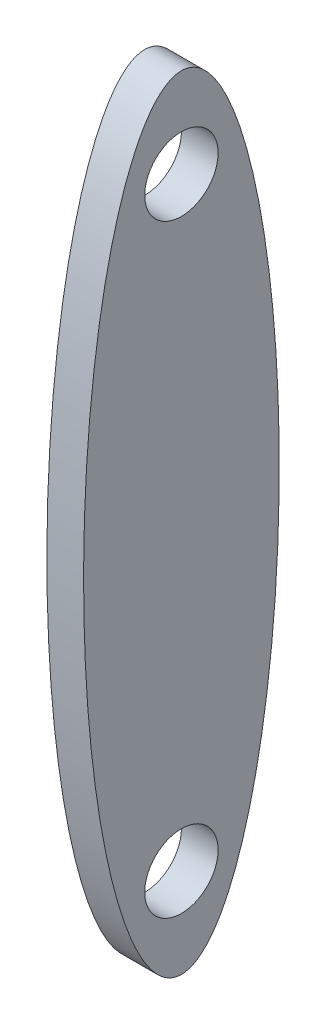
ISO-10303-21;
HEADER;
FILE_DESCRIPTION(('STEP AP214'),'2;1');
FILE_NAME('part.step','',(''),(''),'','','');
FILE_SCHEMA(('AUTOMOTIVE_DESIGN { 1 0 10303 214 1 1 1 1 }'));
ENDSEC;
DATA;
#1=APPLICATION_CONTEXT('core data for automotive mechanical design processes');
#2=APPLICATION_PROTOCOL_DEFINITION('international standard','automotive_design',2000,#1);
#3=PRODUCT_CONTEXT('',#1,'mechanical');
#4=PRODUCT('Part','Part','',(#3));
#5=PRODUCT_RELATED_PRODUCT_CATEGORY('part','',(#4));
#6=PRODUCT_DEFINITION_FORMATION('','',#4);
#7=PRODUCT_DEFINITION_CONTEXT('part definition',#1,'design');
#8=PRODUCT_DEFINITION('design','',#6,#7);
#9=PRODUCT_DEFINITION_SHAPE('','',#8);
#10=(LENGTH_UNIT() NAMED_UNIT(*) SI_UNIT(.MILLI.,.METRE.));
#11=(NAMED_UNIT(*) PLANE_ANGLE_UNIT() SI_UNIT($,.RADIAN.));
#12=(NAMED_UNIT(*) SI_UNIT($,.STERADIAN.) SOLID_ANGLE_UNIT());
#13=UNCERTAINTY_MEASURE_WITH_UNIT(LENGTH_MEASURE(1.E-05),#10,'distance_accuracy_value','');
#14=(GEOMETRIC_REPRESENTATION_CONTEXT(3) GLOBAL_UNCERTAINTY_ASSIGNED_CONTEXT((#13)) GLOBAL_UNIT_ASSIGNED_CONTEXT((#10,
#11,#12)) REPRESENTATION_CONTEXT('',''));
#15=CARTESIAN_POINT('',(0.,0.,0.));
#16=DIRECTION('',(0.,0.,1.));
#17=DIRECTION('',(1.,0.,0.));
#18=AXIS2_PLACEMENT_3D('',#15,#16,#17);
#19=CARTESIAN_POINT('',(4.7625,0.,0.));
#20=DIRECTION('',(1.,0.,0.));
#21=DIRECTION('',(0.,1.,0.));
#22=AXIS2_PLACEMENT_3D('',#19,#20,#21);
#23=ELLIPSE('',#22,50.8,12.7);
#24=DIRECTION('',(-1.,0.,0.));
#25=VECTOR('',#24,1.);
#26=SURFACE_OF_LINEAR_EXTRUSION('',#23,#25);
#27=CARTESIAN_POINT('',(4.7625,50.8,0.));
#28=VERTEX_POINT('',#27);
#29=EDGE_CURVE('E10',#28,#28,#23,.T.);
#30=ORIENTED_EDGE('',*,*,#29,.F.);
#31=EDGE_LOOP('',(#30));
#32=FACE_BOUND('',#31,.T.);
#33=CARTESIAN_POINT('',(0.,0.,0.));
#34=DIRECTION('',(1.,0.,0.));
#35=DIRECTION('',(0.,1.,0.));
#36=AXIS2_PLACEMENT_3D('',#33,#34,#35);
#37=ELLIPSE('',#36,50.8,12.7);
#38=CARTESIAN_POINT('',(0.,50.8,0.));
#39=VERTEX_POINT('',#38);
#40=EDGE_CURVE('E44',#39,#39,#37,.T.);
#41=ORIENTED_EDGE('',*,*,#40,.T.);
#42=EDGE_LOOP('',(#41));
#43=FACE_BOUND('',#42,.T.);
#44=ADVANCED_FACE('F40',(#32,#43),#26,.F.);
#45=CARTESIAN_POINT('',(4.7625,0.,0.));
#46=DIRECTION('',(1.,0.,0.));
#47=DIRECTION('',(0.,0.,-1.));
#48=AXIS2_PLACEMENT_3D('',#45,#46,#47);
#49=PLANE('',#48);
#50=CARTESIAN_POINT('',(4.7625,-39.1763758,0.));
#51=DIRECTION('',(1.,0.,0.));
#52=DIRECTION('',(0.,0.,-1.));
#53=AXIS2_PLACEMENT_3D('',#50,#51,#52);
#54=CIRCLE('',#53,4.7625);
#55=CARTESIAN_POINT('',(4.7625,-39.1763758,-4.7625));
#56=VERTEX_POINT('',#55);
#57=EDGE_CURVE('E59',#56,#56,#54,.T.);
#58=ORIENTED_EDGE('',*,*,#57,.F.);
#59=EDGE_LOOP('',(#58));
#60=FACE_BOUND('',#59,.T.);
#61=CARTESIAN_POINT('',(4.7625,39.1763794089382,0.));
#62=DIRECTION('',(1.,0.,0.));
#63=DIRECTION('',(0.,0.,-1.));
#64=AXIS2_PLACEMENT_3D('',#61,#62,#63);
#65=CIRCLE('',#64,4.7625);
#66=CARTESIAN_POINT('',(4.7625,39.1763794089382,-4.7625));
#67=VERTEX_POINT('',#66);
#68=EDGE_CURVE('E55',#67,#67,#65,.T.);
#69=ORIENTED_EDGE('',*,*,#68,.F.);
#70=EDGE_LOOP('',(#69));
#71=FACE_BOUND('',#70,.T.);
#72=ORIENTED_EDGE('',*,*,#29,.T.);
#73=EDGE_LOOP('',(#72));
#74=FACE_BOUND('',#73,.T.);
#75=ADVANCED_FACE('F74',(#60,#71,#74),#49,.T.);
#76=CARTESIAN_POINT('',(0.,0.,0.));
#77=DIRECTION('',(1.,0.,0.));
#78=DIRECTION('',(0.,0.,-1.));
#79=AXIS2_PLACEMENT_3D('',#76,#77,#78);
#80=PLANE('',#79);
#81=CARTESIAN_POINT('',(0.,-39.1763758,0.));
#82=DIRECTION('',(1.,0.,0.));
#83=DIRECTION('',(0.,0.,-1.));
#84=AXIS2_PLACEMENT_3D('',#81,#82,#83);
#85=CIRCLE('',#84,4.7625);
#86=CARTESIAN_POINT('',(0.,-39.1763758,-4.7625));
#87=VERTEX_POINT('',#86);
#88=EDGE_CURVE('E63',#87,#87,#85,.T.);
#89=ORIENTED_EDGE('',*,*,#88,.T.);
#90=EDGE_LOOP('',(#89));
#91=FACE_BOUND('',#90,.T.);
#92=CARTESIAN_POINT('',(0.,39.1763794089382,0.));
#93=DIRECTION('',(1.,0.,0.));
#94=DIRECTION('',(0.,0.,-1.));
#95=AXIS2_PLACEMENT_3D('',#92,#93,#94);
#96=CIRCLE('',#95,4.7625);
#97=CARTESIAN_POINT('',(0.,39.1763794089382,-4.7625));
#98=VERTEX_POINT('',#97);
#99=EDGE_CURVE('E52',#98,#98,#96,.T.);
#100=ORIENTED_EDGE('',*,*,#99,.T.);
#101=EDGE_LOOP('',(#100));
#102=FACE_BOUND('',#101,.T.);
#103=ORIENTED_EDGE('',*,*,#40,.F.);
#104=EDGE_LOOP('',(#103));
#105=FACE_BOUND('',#104,.T.);
#106=ADVANCED_FACE('F77',(#91,#102,#105),#80,.F.);
#107=CARTESIAN_POINT('',(0.,39.1763794089382,0.));
#108=DIRECTION('',(1.,0.,0.));
#109=DIRECTION('',(0.,0.,-1.));
#110=AXIS2_PLACEMENT_3D('',#107,#108,#109);
#111=CYLINDRICAL_SURFACE('',#110,4.7625);
#112=ORIENTED_EDGE('',*,*,#99,.F.);
#113=EDGE_LOOP('',(#112));
#114=FACE_BOUND('',#113,.T.);
#115=ORIENTED_EDGE('',*,*,#68,.T.);
#116=EDGE_LOOP('',(#115));
#117=FACE_BOUND('',#116,.T.);
#118=ADVANCED_FACE('F81',(#114,#117),#111,.F.);
#119=CARTESIAN_POINT('',(4.7625,-39.1763758,0.));
#120=DIRECTION('',(-1.,0.,0.));
#121=DIRECTION('',(0.,0.,1.));
#122=AXIS2_PLACEMENT_3D('',#119,#120,#121);
#123=CYLINDRICAL_SURFACE('',#122,4.7625);
#124=ORIENTED_EDGE('',*,*,#57,.T.);
#125=EDGE_LOOP('',(#124));
#126=FACE_BOUND('',#125,.T.);
#127=ORIENTED_EDGE('',*,*,#88,.F.);
#128=EDGE_LOOP('',(#127));
#129=FACE_BOUND('',#128,.T.);
#130=ADVANCED_FACE('F71',(#126,#129),#123,.F.);
#131=CLOSED_SHELL('',(#44,#75,#106,#118,#130));
#132=MANIFOLD_SOLID_BREP('B2',#131);
#133=ADVANCED_BREP_SHAPE_REPRESENTATION('',(#18,#132),#14);
#134=SHAPE_DEFINITION_REPRESENTATION(#9,#133);
ENDSEC;
END-ISO-10303-21;
